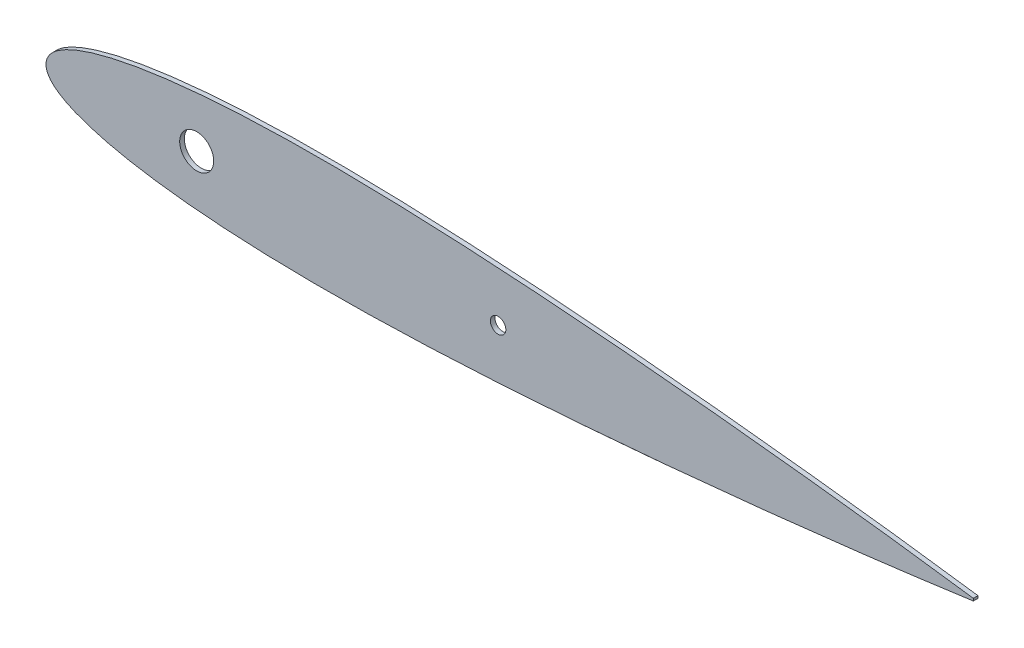
ISO-10303-21;
HEADER;
FILE_DESCRIPTION(('STEP AP214'),'2;1');
FILE_NAME('part.step','',(''),(''),'','','');
FILE_SCHEMA(('AUTOMOTIVE_DESIGN { 1 0 10303 214 1 1 1 1 }'));
ENDSEC;
DATA;
#1=APPLICATION_CONTEXT('core data for automotive mechanical design processes');
#2=APPLICATION_PROTOCOL_DEFINITION('international standard','automotive_design',2000,#1);
#3=PRODUCT_CONTEXT('',#1,'mechanical');
#4=PRODUCT('Part','Part','',(#3));
#5=PRODUCT_RELATED_PRODUCT_CATEGORY('part','',(#4));
#6=PRODUCT_DEFINITION_FORMATION('','',#4);
#7=PRODUCT_DEFINITION_CONTEXT('part definition',#1,'design');
#8=PRODUCT_DEFINITION('design','',#6,#7);
#9=PRODUCT_DEFINITION_SHAPE('','',#8);
#10=(LENGTH_UNIT() NAMED_UNIT(*) SI_UNIT(.MILLI.,.METRE.));
#11=(NAMED_UNIT(*) PLANE_ANGLE_UNIT() SI_UNIT($,.RADIAN.));
#12=(NAMED_UNIT(*) SI_UNIT($,.STERADIAN.) SOLID_ANGLE_UNIT());
#13=UNCERTAINTY_MEASURE_WITH_UNIT(LENGTH_MEASURE(1.E-05),#10,'distance_accuracy_value','');
#14=(GEOMETRIC_REPRESENTATION_CONTEXT(3) GLOBAL_UNCERTAINTY_ASSIGNED_CONTEXT((#13)) GLOBAL_UNIT_ASSIGNED_CONTEXT((#10,
#11,#12)) REPRESENTATION_CONTEXT('',''));
#15=CARTESIAN_POINT('',(0.,0.,0.));
#16=DIRECTION('',(0.,0.,1.));
#17=DIRECTION('',(1.,0.,0.));
#18=AXIS2_PLACEMENT_3D('',#15,#16,#17);
#19=CARTESIAN_POINT('',(300.,0.378000085791609,1.5));
#20=CARTESIAN_POINT('',(299.270406258191,0.479445930510089,1.5));
#21=CARTESIAN_POINT('',(297.234666466675,0.762503926958,1.5));
#22=CARTESIAN_POINT('',(293.659648722087,1.25767379104877,1.5));
#23=CARTESIAN_POINT('',(289.112409324718,1.87424286789427,1.5));
#24=CARTESIAN_POINT('',(284.080813047262,2.54451801768942,1.5));
#25=CARTESIAN_POINT('',(278.752039397676,3.23812305057752,1.5));
#26=CARTESIAN_POINT('',(273.265892957003,3.93494732849236,1.5));
#27=CARTESIAN_POINT('',(267.705948145067,4.62902099310313,1.5));
#28=CARTESIAN_POINT('',(262.11455442435,5.31307031240521,1.5));
#29=CARTESIAN_POINT('',(256.508339041981,5.98219316973479,1.5));
#30=CARTESIAN_POINT('',(250.891727852537,6.63799231512843,1.5));
#31=CARTESIAN_POINT('',(245.269544547784,7.28178088713811,1.5));
#32=CARTESIAN_POINT('',(239.647331655705,7.91223455869203,1.5));
#33=CARTESIAN_POINT('',(234.025115138361,8.52699398080196,1.5));
#34=CARTESIAN_POINT('',(228.399071657966,9.12623183448517,1.5));
#35=CARTESIAN_POINT('',(222.768240122571,9.71307980985144,1.5));
#36=CARTESIAN_POINT('',(217.135901992854,10.2874621437678,1.5));
#37=CARTESIAN_POINT('',(211.505390076212,10.8469435449553,1.5));
#38=CARTESIAN_POINT('',(205.877598448554,11.3916454113055,1.5));
#39=CARTESIAN_POINT('',(200.251489742703,11.9208873285715,1.5));
#40=CARTESIAN_POINT('',(194.626396629031,12.434619899248,1.5));
#41=CARTESIAN_POINT('',(189.002771953878,12.9319147435066,1.5));
#42=CARTESIAN_POINT('',(183.38150447918,13.4131006245795,1.5));
#43=CARTESIAN_POINT('',(177.763197882755,13.8763798492964,1.5));
#44=CARTESIAN_POINT('',(172.14827252579,14.3212404427839,1.5));
#45=CARTESIAN_POINT('',(166.537499181283,14.7478242644365,1.5));
#46=CARTESIAN_POINT('',(160.931704641983,15.1542315822592,1.5));
#47=CARTESIAN_POINT('',(155.33167602762,15.5391043814319,1.5));
#48=CARTESIAN_POINT('',(149.737504253089,15.9026531717,1.5));
#49=CARTESIAN_POINT('',(144.148652919445,16.2418498035663,1.5));
#50=CARTESIAN_POINT('',(138.565642977727,16.5574243030181,1.5));
#51=CARTESIAN_POINT('',(132.990821911634,16.8474013776407,1.5));
#52=CARTESIAN_POINT('',(127.427400286611,17.1102155605444,1.5));
#53=CARTESIAN_POINT('',(121.87757922466,17.3438956525449,1.5));
#54=CARTESIAN_POINT('',(116.340716908339,17.5452607935342,1.5));
#55=CARTESIAN_POINT('',(110.815433459798,17.7126831386236,1.5));
#56=CARTESIAN_POINT('',(105.301229224759,17.8445019865892,1.5));
#57=CARTESIAN_POINT('',(99.8005246938465,17.9400958831729,1.5));
#58=CARTESIAN_POINT('',(94.3173891780333,17.9965945216751,1.5));
#59=CARTESIAN_POINT('',(88.8557161622828,18.0101285441363,1.5));
#60=CARTESIAN_POINT('',(83.4185988364478,17.9792379195058,1.5));
#61=CARTESIAN_POINT('',(78.0084304611897,17.8991647740151,1.5));
#62=CARTESIAN_POINT('',(72.6284037782424,17.7670378182799,1.5));
#63=CARTESIAN_POINT('',(67.2826859463777,17.5794179221707,1.5));
#64=CARTESIAN_POINT('',(61.9773108914633,17.3315194209053,1.5));
#65=CARTESIAN_POINT('',(56.720635819959,17.021036512879,1.5));
#66=CARTESIAN_POINT('',(51.5251189470169,16.6409618454021,1.5));
#67=CARTESIAN_POINT('',(46.4081450832693,16.1901922640123,1.5));
#68=CARTESIAN_POINT('',(41.3941173921595,15.6616726526715,1.5));
#69=CARTESIAN_POINT('',(36.5156113066675,15.0539671994517,1.5));
#70=CARTESIAN_POINT('',(31.8189485954638,14.3656268642819,1.5));
#71=CARTESIAN_POINT('',(27.3661029727955,13.6034787702631,1.5));
#72=CARTESIAN_POINT('',(23.2351551610893,12.7825863440271,1.5));
#73=CARTESIAN_POINT('',(19.5025788109587,11.9202534557745,1.5));
#74=CARTESIAN_POINT('',(16.2182070077725,11.0446003021048,1.5));
#75=CARTESIAN_POINT('',(13.3891209887171,10.17507856394,1.5));
#76=CARTESIAN_POINT('',(10.9848637611105,9.33350083301349,1.5));
#77=CARTESIAN_POINT('',(8.96149544609951,8.52206481504193,1.5));
#78=CARTESIAN_POINT('',(7.26722563700955,7.74697775939542,1.5));
#79=CARTESIAN_POINT('',(5.84598572737673,7.01062721234568,1.5));
#80=CARTESIAN_POINT('',(4.64764407483787,6.30063546243398,1.5));
#81=CARTESIAN_POINT('',(3.62816800978606,5.60651493999262,1.5));
#82=CARTESIAN_POINT('',(2.75184175672906,4.92663636939089,1.5));
#83=CARTESIAN_POINT('',(2.00618975072553,4.24991822327021,1.5));
#84=CARTESIAN_POINT('',(1.39051838755926,3.57026030201865,1.5));
#85=CARTESIAN_POINT('',(0.90093257460337,2.89094290818633,1.5));
#86=CARTESIAN_POINT('',(0.529207590380769,2.22021977713321,1.5));
#87=CARTESIAN_POINT('',(0.260411531407396,1.56645929130344,1.5));
#88=CARTESIAN_POINT('',(0.0856446086735938,0.931036139353968,1.5));
#89=CARTESIAN_POINT('',(-0.00357731260794587,0.308981084614044,1.5));
#90=CARTESIAN_POINT('',(-0.00357731260776069,-0.308981084614867,1.5));
#91=CARTESIAN_POINT('',(0.085644608673676,-0.931036139354734,1.5));
#92=CARTESIAN_POINT('',(0.260411531407617,-1.56645929130417,1.5));
#93=CARTESIAN_POINT('',(0.529207590381385,-2.22021977713395,1.5));
#94=CARTESIAN_POINT('',(0.900932574603896,-2.89094290818701,1.5));
#95=CARTESIAN_POINT('',(1.39051838755998,-3.57026030201885,1.5));
#96=CARTESIAN_POINT('',(2.00618975072612,-4.2499182232723,1.5));
#97=CARTESIAN_POINT('',(2.75184175673132,-4.92663636938401,1.5));
#98=CARTESIAN_POINT('',(3.62816800978219,-5.60651494002358,1.5));
#99=CARTESIAN_POINT('',(4.64764407486163,-6.30063546229814,1.5));
#100=CARTESIAN_POINT('',(5.84598572727589,-7.01062721295839,1.5));
#101=CARTESIAN_POINT('',(7.26722563748649,-7.74697775654588,1.5));
#102=CARTESIAN_POINT('',(8.96149544385088,-8.52206482852457,1.5));
#103=CARTESIAN_POINT('',(10.9848637718125,-9.33350076889672,1.5));
#104=CARTESIAN_POINT('',(13.3891209381216,-10.1750788671249,1.5));
#105=CARTESIAN_POINT('',(16.2182072447028,-11.0445988824027,1.5));
#106=CARTESIAN_POINT('',(19.5025777214158,-11.9202599844474,1.5));
#107=CARTESIAN_POINT('',(23.2351600059408,-12.7825573131507,1.5));
#108=CARTESIAN_POINT('',(27.366065702866,-13.6035992472578,1.5));
#109=CARTESIAN_POINT('',(31.8190141628903,-14.3651166226759,1.5));
#110=CARTESIAN_POINT('',(36.5155748574454,-15.0541095127906,1.5));
#111=CARTESIAN_POINT('',(41.3941235310746,-15.6616324404357,1.5));
#112=CARTESIAN_POINT('',(46.4081433882142,-16.1902033672853,1.5));
#113=CARTESIAN_POINT('',(51.5251194115053,-16.6409588028351,1.5));
#114=CARTESIAN_POINT('',(56.7206356933644,-17.021037342131,1.5));
#115=CARTESIAN_POINT('',(61.9773109258477,-17.3315191956822,1.5));
#116=CARTESIAN_POINT('',(67.282685937066,-17.579417983174,1.5));
#117=CARTESIAN_POINT('',(72.628403780765,-17.7670378017618,1.5));
#118=CARTESIAN_POINT('',(78.0084304605122,-17.8991647784589,1.5));
#119=CARTESIAN_POINT('',(83.4185988366347,-17.9792379182857,1.5));
#120=CARTESIAN_POINT('',(88.8557161622366,-18.0101285444439,1.5));
#121=CARTESIAN_POINT('',(94.31738917805,-17.996594521569,1.5));
#122=CARTESIAN_POINT('',(99.8005246938458,-17.9400958831769,1.5));
#123=CARTESIAN_POINT('',(105.301229224764,-17.8445019865623,1.5));
#124=CARTESIAN_POINT('',(110.8154334598,-17.7126831386035,1.5));
#125=CARTESIAN_POINT('',(116.340716908343,-17.5452607935109,1.5));
#126=CARTESIAN_POINT('',(121.877579224663,-17.3438956525209,1.5));
#127=CARTESIAN_POINT('',(127.427400286614,-17.1102155605192,1.5));
#128=CARTESIAN_POINT('',(132.990821911636,-16.8474013776144,1.5));
#129=CARTESIAN_POINT('',(138.56564297773,-16.5574243029907,1.5));
#130=CARTESIAN_POINT('',(144.148652919448,-16.2418498035377,1.5));
#131=CARTESIAN_POINT('',(149.737504253092,-15.9026531716702,1.5));
#132=CARTESIAN_POINT('',(155.331676027623,-15.5391043814009,1.5));
#133=CARTESIAN_POINT('',(160.931704641986,-15.1542315822272,1.5));
#134=CARTESIAN_POINT('',(166.537499181286,-14.7478242644034,1.5));
#135=CARTESIAN_POINT('',(172.148272525793,-14.3212404427496,1.5));
#136=CARTESIAN_POINT('',(177.763197882757,-13.8763798492609,1.5));
#137=CARTESIAN_POINT('',(183.381504479182,-13.4131006245429,1.5));
#138=CARTESIAN_POINT('',(189.002771953881,-12.9319147434689,1.5));
#139=CARTESIAN_POINT('',(194.626396629033,-12.4346198992091,1.5));
#140=CARTESIAN_POINT('',(200.251489742704,-11.9208873285315,1.5));
#141=CARTESIAN_POINT('',(205.877598448556,-11.3916454112643,1.5));
#142=CARTESIAN_POINT('',(211.505390076214,-10.846943544913,1.5));
#143=CARTESIAN_POINT('',(217.135901992857,-10.2874621437243,1.5));
#144=CARTESIAN_POINT('',(222.768240122572,-9.71307980980683,1.5));
#145=CARTESIAN_POINT('',(228.399071657967,-9.12623183443944,1.5));
#146=CARTESIAN_POINT('',(234.025115138362,-8.52699398075506,1.5));
#147=CARTESIAN_POINT('',(239.647331655707,-7.91223455864399,1.5));
#148=CARTESIAN_POINT('',(245.269544547784,-7.28178088708888,1.5));
#149=CARTESIAN_POINT('',(250.891727852538,-6.63799231507812,1.5));
#150=CARTESIAN_POINT('',(256.508339041983,-5.9821931696833,1.5));
#151=CARTESIAN_POINT('',(262.114554424351,-5.31307031235259,1.5));
#152=CARTESIAN_POINT('',(267.705948145068,-4.62902099304935,1.5));
#153=CARTESIAN_POINT('',(273.265892957004,-3.93494732843744,1.5));
#154=CARTESIAN_POINT('',(278.752039397677,-3.23812305052151,1.5));
#155=CARTESIAN_POINT('',(284.080813047263,-2.54451801763229,1.5));
#156=CARTESIAN_POINT('',(289.112409324719,-1.87424286783615,1.5));
#157=CARTESIAN_POINT('',(293.659648722086,-1.2576737909897,1.5));
#158=CARTESIAN_POINT('',(297.234666466675,-0.762503926898206,1.5));
#159=CARTESIAN_POINT('',(299.270406258191,-0.479445930449888,1.5));
#160=CARTESIAN_POINT('',(300.,-0.378000085731248,1.5));
#161=B_SPLINE_CURVE_WITH_KNOTS('',3,(#19,#20,#21,#22,#23,#24,#25,#26,#27,#28,#29,#30,#31,#32,
#33,#34,#35,#36,#37,#38,#39,#40,#41,#42,#43,#44,#45,#46,#47,#48,#49,#50,#51,#52,#53,#54,#55,#56,
#57,#58,#59,#60,#61,#62,#63,#64,#65,#66,#67,#68,#69,#70,#71,#72,#73,#74,#75,#76,#77,#78,#79,#80,
#81,#82,#83,#84,#85,#86,#87,#88,#89,#90,#91,#92,#93,#94,#95,#96,#97,#98,#99,#100,#101,#102,#103,
#104,#105,#106,#107,#108,#109,#110,#111,#112,#113,#114,#115,#116,#117,#118,#119,#120,#121,#122,
#123,#124,#125,#126,#127,#128,#129,#130,#131,#132,#133,#134,#135,#136,#137,#138,#139,#140,#141,
#142,#143,#144,#145,#146,#147,#148,#149,#150,#151,#152,#153,#154,#155,#156,#157,#158,#159,#160),
.UNSPECIFIED.,.F.,.F.,(4,1,1,1,1,1,1,1,1,1,1,1,1,1,1,1,1,1,1,1,1,1,1,1,1,1,1,1,1,1,1,1,1,1,1,1,
1,1,1,1,1,1,1,1,1,1,1,1,1,1,1,1,1,1,1,1,1,1,1,1,1,1,1,1,1,1,1,1,1,1,1,1,1,1,1,1,1,1,1,1,1,1,1,1,
1,1,1,1,1,1,1,1,1,1,1,1,1,1,1,1,1,1,1,1,1,1,1,1,1,1,1,1,1,1,1,1,1,1,1,1,1,1,1,1,1,1,1,1,1,1,1,1,
1,1,1,1,1,1,1,4),(0.,0.00361222059404388,0.0100789532278554,0.0176986181570895,
0.0261151107220122,0.0349709660638799,0.0440503796486832,0.0532343297369713,0.0624475697827881,
0.0716739929600303,0.0809213185094618,0.0901775382979332,0.0994243421366575,0.108664440992277,
0.117912199004999,0.127169502180609,0.136426594565023,0.145675425736823,0.154916495397513,
0.164153236916375,0.173386648526191,0.182615736180586,0.191838089492061,0.201053134496137,
0.210260392550908,0.219458942389608,0.228646746886173,0.237822316287067,0.24698522413025,
0.25613738364592,0.265279415916296,0.274406949966901,0.283512193452554,0.292591781113348,
0.30164628535433,0.310681792653752,0.31969906757785,0.32869451957993,0.337660159695399,
0.346588583205171,0.355477411634764,0.364322937295264,0.373121613643215,0.381867635356829,
0.390553004884712,0.399166025869356,0.407689628257838,0.416098119030288,0.424354887451602,
0.432412428746428,0.440204728485537,0.447630505181733,0.454563637698397,0.460855379429517,
0.466413319364109,0.471228610451128,0.475365774282038,0.478901259753558,0.481915077255184,
0.484498871900912,0.486747127386087,0.488741251833575,0.490543179252672,0.492182103901344,
0.493672830547239,0.495031907807012,0.496279059618418,0.497424736506128,0.498490165528455,
0.499502757789975,0.500497253863142,0.501509846124661,0.502575275146988,0.503720952034698,
0.504968103846104,0.506327181105877,0.507817907751772,0.509456832400444,0.511258759819541,
0.51325288426703,0.515501139752205,0.518084934397933,0.521098751899559,0.524634237371078,
0.528771401201989,0.533586692289008,0.539144632223599,0.545436373954719,0.552369506471383,
0.559795200118754,0.567587571253572,0.575645112548398,0.583901880969712,0.592310371742162,
0.600833974130644,0.609446995115288,0.618132364643171,0.626878386356785,0.635677062704736,
0.644522588365236,0.653411416794829,0.662339840304601,0.67130548042007,0.68030093242215,
0.689318207346248,0.69835371464567,0.707408218886652,0.716487806547446,0.725593050033099,
0.734720584083704,0.74386261635408,0.75301477586975,0.762177683712933,0.771353253113827,
0.780541057610392,0.789739607449093,0.798946865503863,0.808161910507939,0.817384263819414,
0.826613351473809,0.835846763083625,0.845083504602487,0.854324574263177,0.863573405434977,
0.872830497819391,0.882087800995001,0.891335559007723,0.900575657863343,0.909822461702067,
0.919078681490538,0.92832600703997,0.937552430217212,0.946765670263029,0.955949620351317,
0.96502903393612,0.973884889277988,0.982301381842911,0.989921046772145,0.996387779405956,1.),.UNSPECIFIED.);
#162=DIRECTION('',(0.,0.,-1.));
#163=VECTOR('',#162,1.);
#164=SURFACE_OF_LINEAR_EXTRUSION('',#161,#163);
#165=CARTESIAN_POINT('',(300.,0.378000085791609,0.));
#166=CARTESIAN_POINT('',(299.270406258191,0.479445930510089,0.));
#167=CARTESIAN_POINT('',(297.234666466675,0.762503926958,0.));
#168=CARTESIAN_POINT('',(293.659648722087,1.25767379104877,0.));
#169=CARTESIAN_POINT('',(289.112409324718,1.87424286789427,0.));
#170=CARTESIAN_POINT('',(284.080813047262,2.54451801768942,0.));
#171=CARTESIAN_POINT('',(278.752039397676,3.23812305057752,0.));
#172=CARTESIAN_POINT('',(273.265892957003,3.93494732849236,0.));
#173=CARTESIAN_POINT('',(267.705948145067,4.62902099310313,0.));
#174=CARTESIAN_POINT('',(262.11455442435,5.31307031240521,0.));
#175=CARTESIAN_POINT('',(256.508339041981,5.98219316973479,0.));
#176=CARTESIAN_POINT('',(250.891727852537,6.63799231512843,0.));
#177=CARTESIAN_POINT('',(245.269544547784,7.28178088713811,0.));
#178=CARTESIAN_POINT('',(239.647331655705,7.91223455869203,0.));
#179=CARTESIAN_POINT('',(234.025115138361,8.52699398080196,0.));
#180=CARTESIAN_POINT('',(228.399071657966,9.12623183448517,0.));
#181=CARTESIAN_POINT('',(222.768240122571,9.71307980985144,0.));
#182=CARTESIAN_POINT('',(217.135901992854,10.2874621437678,0.));
#183=CARTESIAN_POINT('',(211.505390076212,10.8469435449553,0.));
#184=CARTESIAN_POINT('',(205.877598448554,11.3916454113055,0.));
#185=CARTESIAN_POINT('',(200.251489742703,11.9208873285715,0.));
#186=CARTESIAN_POINT('',(194.626396629031,12.434619899248,0.));
#187=CARTESIAN_POINT('',(189.002771953878,12.9319147435066,0.));
#188=CARTESIAN_POINT('',(183.38150447918,13.4131006245795,0.));
#189=CARTESIAN_POINT('',(177.763197882755,13.8763798492964,0.));
#190=CARTESIAN_POINT('',(172.14827252579,14.3212404427839,0.));
#191=CARTESIAN_POINT('',(166.537499181283,14.7478242644365,0.));
#192=CARTESIAN_POINT('',(160.931704641983,15.1542315822592,0.));
#193=CARTESIAN_POINT('',(155.33167602762,15.5391043814319,0.));
#194=CARTESIAN_POINT('',(149.737504253089,15.9026531717,0.));
#195=CARTESIAN_POINT('',(144.148652919445,16.2418498035663,0.));
#196=CARTESIAN_POINT('',(138.565642977727,16.5574243030181,0.));
#197=CARTESIAN_POINT('',(132.990821911634,16.8474013776407,0.));
#198=CARTESIAN_POINT('',(127.427400286611,17.1102155605444,0.));
#199=CARTESIAN_POINT('',(121.87757922466,17.3438956525449,0.));
#200=CARTESIAN_POINT('',(116.340716908339,17.5452607935342,0.));
#201=CARTESIAN_POINT('',(110.815433459798,17.7126831386236,0.));
#202=CARTESIAN_POINT('',(105.301229224759,17.8445019865892,0.));
#203=CARTESIAN_POINT('',(99.8005246938465,17.9400958831729,0.));
#204=CARTESIAN_POINT('',(94.3173891780333,17.9965945216751,0.));
#205=CARTESIAN_POINT('',(88.8557161622828,18.0101285441363,0.));
#206=CARTESIAN_POINT('',(83.4185988364478,17.9792379195058,0.));
#207=CARTESIAN_POINT('',(78.0084304611897,17.8991647740151,0.));
#208=CARTESIAN_POINT('',(72.6284037782424,17.7670378182799,0.));
#209=CARTESIAN_POINT('',(67.2826859463777,17.5794179221707,0.));
#210=CARTESIAN_POINT('',(61.9773108914633,17.3315194209053,0.));
#211=CARTESIAN_POINT('',(56.720635819959,17.021036512879,0.));
#212=CARTESIAN_POINT('',(51.5251189470169,16.6409618454021,0.));
#213=CARTESIAN_POINT('',(46.4081450832693,16.1901922640123,0.));
#214=CARTESIAN_POINT('',(41.3941173921595,15.6616726526715,0.));
#215=CARTESIAN_POINT('',(36.5156113066675,15.0539671994517,0.));
#216=CARTESIAN_POINT('',(31.8189485954638,14.3656268642819,0.));
#217=CARTESIAN_POINT('',(27.3661029727955,13.6034787702631,0.));
#218=CARTESIAN_POINT('',(23.2351551610893,12.7825863440271,0.));
#219=CARTESIAN_POINT('',(19.5025788109587,11.9202534557745,0.));
#220=CARTESIAN_POINT('',(16.2182070077725,11.0446003021048,0.));
#221=CARTESIAN_POINT('',(13.3891209887171,10.17507856394,0.));
#222=CARTESIAN_POINT('',(10.9848637611105,9.33350083301349,0.));
#223=CARTESIAN_POINT('',(8.96149544609951,8.52206481504193,0.));
#224=CARTESIAN_POINT('',(7.26722563700955,7.74697775939542,0.));
#225=CARTESIAN_POINT('',(5.84598572737673,7.01062721234568,0.));
#226=CARTESIAN_POINT('',(4.64764407483787,6.30063546243398,0.));
#227=CARTESIAN_POINT('',(3.62816800978606,5.60651493999262,0.));
#228=CARTESIAN_POINT('',(2.75184175672906,4.92663636939089,0.));
#229=CARTESIAN_POINT('',(2.00618975072553,4.24991822327021,0.));
#230=CARTESIAN_POINT('',(1.39051838755926,3.57026030201865,0.));
#231=CARTESIAN_POINT('',(0.90093257460337,2.89094290818633,0.));
#232=CARTESIAN_POINT('',(0.529207590380769,2.22021977713321,0.));
#233=CARTESIAN_POINT('',(0.260411531407396,1.56645929130344,0.));
#234=CARTESIAN_POINT('',(0.0856446086735938,0.931036139353968,0.));
#235=CARTESIAN_POINT('',(-0.00357731260794587,0.308981084614044,0.));
#236=CARTESIAN_POINT('',(-0.00357731260776069,-0.308981084614867,0.));
#237=CARTESIAN_POINT('',(0.085644608673676,-0.931036139354734,0.));
#238=CARTESIAN_POINT('',(0.260411531407617,-1.56645929130417,0.));
#239=CARTESIAN_POINT('',(0.529207590381385,-2.22021977713395,0.));
#240=CARTESIAN_POINT('',(0.900932574603896,-2.89094290818701,0.));
#241=CARTESIAN_POINT('',(1.39051838755998,-3.57026030201885,0.));
#242=CARTESIAN_POINT('',(2.00618975072612,-4.2499182232723,0.));
#243=CARTESIAN_POINT('',(2.75184175673132,-4.92663636938401,0.));
#244=CARTESIAN_POINT('',(3.62816800978219,-5.60651494002358,0.));
#245=CARTESIAN_POINT('',(4.64764407486163,-6.30063546229814,0.));
#246=CARTESIAN_POINT('',(5.84598572727589,-7.01062721295839,0.));
#247=CARTESIAN_POINT('',(7.26722563748649,-7.74697775654588,0.));
#248=CARTESIAN_POINT('',(8.96149544385088,-8.52206482852457,0.));
#249=CARTESIAN_POINT('',(10.9848637718125,-9.33350076889672,0.));
#250=CARTESIAN_POINT('',(13.3891209381216,-10.1750788671249,0.));
#251=CARTESIAN_POINT('',(16.2182072447028,-11.0445988824027,0.));
#252=CARTESIAN_POINT('',(19.5025777214158,-11.9202599844474,0.));
#253=CARTESIAN_POINT('',(23.2351600059408,-12.7825573131507,0.));
#254=CARTESIAN_POINT('',(27.366065702866,-13.6035992472578,0.));
#255=CARTESIAN_POINT('',(31.8190141628903,-14.3651166226759,0.));
#256=CARTESIAN_POINT('',(36.5155748574454,-15.0541095127906,0.));
#257=CARTESIAN_POINT('',(41.3941235310746,-15.6616324404357,0.));
#258=CARTESIAN_POINT('',(46.4081433882142,-16.1902033672853,0.));
#259=CARTESIAN_POINT('',(51.5251194115053,-16.6409588028351,0.));
#260=CARTESIAN_POINT('',(56.7206356933644,-17.021037342131,0.));
#261=CARTESIAN_POINT('',(61.9773109258477,-17.3315191956822,0.));
#262=CARTESIAN_POINT('',(67.282685937066,-17.579417983174,0.));
#263=CARTESIAN_POINT('',(72.628403780765,-17.7670378017618,0.));
#264=CARTESIAN_POINT('',(78.0084304605122,-17.8991647784589,0.));
#265=CARTESIAN_POINT('',(83.4185988366347,-17.9792379182857,0.));
#266=CARTESIAN_POINT('',(88.8557161622366,-18.0101285444439,0.));
#267=CARTESIAN_POINT('',(94.31738917805,-17.996594521569,0.));
#268=CARTESIAN_POINT('',(99.8005246938458,-17.9400958831769,0.));
#269=CARTESIAN_POINT('',(105.301229224764,-17.8445019865623,0.));
#270=CARTESIAN_POINT('',(110.8154334598,-17.7126831386035,0.));
#271=CARTESIAN_POINT('',(116.340716908343,-17.5452607935109,0.));
#272=CARTESIAN_POINT('',(121.877579224663,-17.3438956525209,0.));
#273=CARTESIAN_POINT('',(127.427400286614,-17.1102155605192,0.));
#274=CARTESIAN_POINT('',(132.990821911636,-16.8474013776144,0.));
#275=CARTESIAN_POINT('',(138.56564297773,-16.5574243029907,0.));
#276=CARTESIAN_POINT('',(144.148652919448,-16.2418498035377,0.));
#277=CARTESIAN_POINT('',(149.737504253092,-15.9026531716702,0.));
#278=CARTESIAN_POINT('',(155.331676027623,-15.5391043814009,0.));
#279=CARTESIAN_POINT('',(160.931704641986,-15.1542315822272,0.));
#280=CARTESIAN_POINT('',(166.537499181286,-14.7478242644034,0.));
#281=CARTESIAN_POINT('',(172.148272525793,-14.3212404427496,0.));
#282=CARTESIAN_POINT('',(177.763197882757,-13.8763798492609,0.));
#283=CARTESIAN_POINT('',(183.381504479182,-13.4131006245429,0.));
#284=CARTESIAN_POINT('',(189.002771953881,-12.9319147434689,0.));
#285=CARTESIAN_POINT('',(194.626396629033,-12.4346198992091,0.));
#286=CARTESIAN_POINT('',(200.251489742704,-11.9208873285315,0.));
#287=CARTESIAN_POINT('',(205.877598448556,-11.3916454112643,0.));
#288=CARTESIAN_POINT('',(211.505390076214,-10.846943544913,0.));
#289=CARTESIAN_POINT('',(217.135901992857,-10.2874621437243,0.));
#290=CARTESIAN_POINT('',(222.768240122572,-9.71307980980683,0.));
#291=CARTESIAN_POINT('',(228.399071657967,-9.12623183443944,0.));
#292=CARTESIAN_POINT('',(234.025115138362,-8.52699398075506,0.));
#293=CARTESIAN_POINT('',(239.647331655707,-7.91223455864399,0.));
#294=CARTESIAN_POINT('',(245.269544547784,-7.28178088708888,0.));
#295=CARTESIAN_POINT('',(250.891727852538,-6.63799231507812,0.));
#296=CARTESIAN_POINT('',(256.508339041983,-5.9821931696833,0.));
#297=CARTESIAN_POINT('',(262.114554424351,-5.31307031235259,0.));
#298=CARTESIAN_POINT('',(267.705948145068,-4.62902099304935,0.));
#299=CARTESIAN_POINT('',(273.265892957004,-3.93494732843744,0.));
#300=CARTESIAN_POINT('',(278.752039397677,-3.23812305052151,0.));
#301=CARTESIAN_POINT('',(284.080813047263,-2.54451801763229,0.));
#302=CARTESIAN_POINT('',(289.112409324719,-1.87424286783615,0.));
#303=CARTESIAN_POINT('',(293.659648722086,-1.2576737909897,0.));
#304=CARTESIAN_POINT('',(297.234666466675,-0.762503926898206,0.));
#305=CARTESIAN_POINT('',(299.270406258191,-0.479445930449888,0.));
#306=CARTESIAN_POINT('',(300.,-0.378000085731248,0.));
#307=B_SPLINE_CURVE_WITH_KNOTS('',3,(#165,#166,#167,#168,#169,#170,#171,#172,#173,#174,#175,
#176,#177,#178,#179,#180,#181,#182,#183,#184,#185,#186,#187,#188,#189,#190,#191,#192,#193,#194,
#195,#196,#197,#198,#199,#200,#201,#202,#203,#204,#205,#206,#207,#208,#209,#210,#211,#212,#213,
#214,#215,#216,#217,#218,#219,#220,#221,#222,#223,#224,#225,#226,#227,#228,#229,#230,#231,#232,
#233,#234,#235,#236,#237,#238,#239,#240,#241,#242,#243,#244,#245,#246,#247,#248,#249,#250,#251,
#252,#253,#254,#255,#256,#257,#258,#259,#260,#261,#262,#263,#264,#265,#266,#267,#268,#269,#270,
#271,#272,#273,#274,#275,#276,#277,#278,#279,#280,#281,#282,#283,#284,#285,#286,#287,#288,#289,
#290,#291,#292,#293,#294,#295,#296,#297,#298,#299,#300,#301,#302,#303,#304,#305,#306),
.UNSPECIFIED.,.F.,.F.,(4,1,1,1,1,1,1,1,1,1,1,1,1,1,1,1,1,1,1,1,1,1,1,1,1,1,1,1,1,1,1,1,1,1,1,1,
1,1,1,1,1,1,1,1,1,1,1,1,1,1,1,1,1,1,1,1,1,1,1,1,1,1,1,1,1,1,1,1,1,1,1,1,1,1,1,1,1,1,1,1,1,1,1,1,
1,1,1,1,1,1,1,1,1,1,1,1,1,1,1,1,1,1,1,1,1,1,1,1,1,1,1,1,1,1,1,1,1,1,1,1,1,1,1,1,1,1,1,1,1,1,1,1,
1,1,1,1,1,1,1,4),(0.,0.00361222059404388,0.0100789532278554,0.0176986181570895,
0.0261151107220122,0.0349709660638799,0.0440503796486832,0.0532343297369713,0.0624475697827881,
0.0716739929600303,0.0809213185094618,0.0901775382979332,0.0994243421366575,0.108664440992277,
0.117912199004999,0.127169502180609,0.136426594565023,0.145675425736823,0.154916495397513,
0.164153236916375,0.173386648526191,0.182615736180586,0.191838089492061,0.201053134496137,
0.210260392550908,0.219458942389608,0.228646746886173,0.237822316287067,0.24698522413025,
0.25613738364592,0.265279415916296,0.274406949966901,0.283512193452554,0.292591781113348,
0.30164628535433,0.310681792653752,0.31969906757785,0.32869451957993,0.337660159695399,
0.346588583205171,0.355477411634764,0.364322937295264,0.373121613643215,0.381867635356829,
0.390553004884712,0.399166025869356,0.407689628257838,0.416098119030288,0.424354887451602,
0.432412428746428,0.440204728485537,0.447630505181733,0.454563637698397,0.460855379429517,
0.466413319364109,0.471228610451128,0.475365774282038,0.478901259753558,0.481915077255184,
0.484498871900912,0.486747127386087,0.488741251833575,0.490543179252672,0.492182103901344,
0.493672830547239,0.495031907807012,0.496279059618418,0.497424736506128,0.498490165528455,
0.499502757789975,0.500497253863142,0.501509846124661,0.502575275146988,0.503720952034698,
0.504968103846104,0.506327181105877,0.507817907751772,0.509456832400444,0.511258759819541,
0.51325288426703,0.515501139752205,0.518084934397933,0.521098751899559,0.524634237371078,
0.528771401201989,0.533586692289008,0.539144632223599,0.545436373954719,0.552369506471383,
0.559795200118754,0.567587571253572,0.575645112548398,0.583901880969712,0.592310371742162,
0.600833974130644,0.609446995115288,0.618132364643171,0.626878386356785,0.635677062704736,
0.644522588365236,0.653411416794829,0.662339840304601,0.67130548042007,0.68030093242215,
0.689318207346248,0.69835371464567,0.707408218886652,0.716487806547446,0.725593050033099,
0.734720584083704,0.74386261635408,0.75301477586975,0.762177683712933,0.771353253113827,
0.780541057610392,0.789739607449093,0.798946865503863,0.808161910507939,0.817384263819414,
0.826613351473809,0.835846763083625,0.845083504602487,0.854324574263177,0.863573405434977,
0.872830497819391,0.882087800995001,0.891335559007723,0.900575657863343,0.909822461702067,
0.919078681490538,0.92832600703997,0.937552430217212,0.946765670263029,0.955949620351317,
0.96502903393612,0.973884889277988,0.982301381842911,0.989921046772145,0.996387779405956,1.),.UNSPECIFIED.);
#308=CARTESIAN_POINT('',(300.,0.378000085791609,0.));
#309=VERTEX_POINT('',#308);
#310=CARTESIAN_POINT('',(300.,-0.378000085731248,0.));
#311=VERTEX_POINT('',#310);
#312=EDGE_CURVE('E69',#309,#311,#307,.T.);
#313=ORIENTED_EDGE('',*,*,#312,.T.);
#314=DIRECTION('',(0.,0.,-1.));
#315=VECTOR('',#314,1.);
#316=CARTESIAN_POINT('',(300.,-0.378000085731248,1.5));
#317=LINE('',#316,#315);
#318=CARTESIAN_POINT('',(300.,-0.378000085731248,1.5));
#319=VERTEX_POINT('',#318);
#320=EDGE_CURVE('E11',#319,#311,#317,.T.);
#321=ORIENTED_EDGE('',*,*,#320,.F.);
#322=CARTESIAN_POINT('',(300.,0.378000085791609,1.5));
#323=VERTEX_POINT('',#322);
#324=EDGE_CURVE('E68',#323,#319,#161,.T.);
#325=ORIENTED_EDGE('',*,*,#324,.F.);
#326=DIRECTION('',(0.,0.,-1.));
#327=VECTOR('',#326,1.);
#328=CARTESIAN_POINT('',(300.,0.378000085791609,1.5));
#329=LINE('',#328,#327);
#330=EDGE_CURVE('E46',#323,#309,#329,.T.);
#331=ORIENTED_EDGE('',*,*,#330,.T.);
#332=EDGE_LOOP('',(#313,#321,#325,#331));
#333=FACE_BOUND('',#332,.T.);
#334=ADVANCED_FACE('F37',(#333),#164,.F.);
#335=CARTESIAN_POINT('',(300.,0.378000085791609,1.5));
#336=DIRECTION('',(-1.,0.,0.));
#337=DIRECTION('',(0.,0.,1.));
#338=AXIS2_PLACEMENT_3D('',#335,#336,#337);
#339=PLANE('',#338);
#340=DIRECTION('',(0.,1.,0.));
#341=VECTOR('',#340,1.);
#342=CARTESIAN_POINT('',(300.,0.378000085791609,0.));
#343=LINE('',#342,#341);
#344=EDGE_CURVE('E61',#311,#309,#343,.T.);
#345=ORIENTED_EDGE('',*,*,#344,.T.);
#346=ORIENTED_EDGE('',*,*,#330,.F.);
#347=DIRECTION('',(0.,1.,0.));
#348=VECTOR('',#347,1.);
#349=CARTESIAN_POINT('',(300.,0.378000085791609,1.5));
#350=LINE('',#349,#348);
#351=EDGE_CURVE('E53',#319,#323,#350,.T.);
#352=ORIENTED_EDGE('',*,*,#351,.F.);
#353=ORIENTED_EDGE('',*,*,#320,.T.);
#354=EDGE_LOOP('',(#345,#346,#352,#353));
#355=FACE_BOUND('',#354,.T.);
#356=ADVANCED_FACE('F64',(#355),#339,.F.);
#357=CARTESIAN_POINT('',(1.47835777548036E-12,3.56765419866399E-06,1.5));
#358=DIRECTION('',(0.,0.,-1.));
#359=DIRECTION('',(-1.,0.,0.));
#360=AXIS2_PLACEMENT_3D('',#357,#358,#359);
#361=PLANE('',#360);
#362=CARTESIAN_POINT('',(48.75,0.,1.5));
#363=DIRECTION('',(0.,0.,1.));
#364=DIRECTION('',(1.,0.,0.));
#365=AXIS2_PLACEMENT_3D('',#362,#363,#364);
#366=CIRCLE('',#365,5.50000000000002);
#367=CARTESIAN_POINT('',(54.25,0.,1.5));
#368=VERTEX_POINT('',#367);
#369=EDGE_CURVE('E76',#368,#368,#366,.T.);
#370=ORIENTED_EDGE('',*,*,#369,.F.);
#371=EDGE_LOOP('',(#370));
#372=FACE_BOUND('',#371,.T.);
#373=CARTESIAN_POINT('',(146.25,0.,1.5));
#374=DIRECTION('',(0.,0.,1.));
#375=DIRECTION('',(1.,0.,0.));
#376=AXIS2_PLACEMENT_3D('',#373,#374,#375);
#377=CIRCLE('',#376,2.50000000000002);
#378=CARTESIAN_POINT('',(148.75,0.,1.5));
#379=VERTEX_POINT('',#378);
#380=EDGE_CURVE('E88',#379,#379,#377,.T.);
#381=ORIENTED_EDGE('',*,*,#380,.F.);
#382=EDGE_LOOP('',(#381));
#383=FACE_BOUND('',#382,.T.);
#384=ORIENTED_EDGE('',*,*,#324,.T.);
#385=ORIENTED_EDGE('',*,*,#351,.T.);
#386=EDGE_LOOP('',(#384,#385));
#387=FACE_BOUND('',#386,.T.);
#388=ADVANCED_FACE('F102',(#372,#383,#387),#361,.F.);
#389=CARTESIAN_POINT('',(1.47835777548036E-12,3.56765419866399E-06,0.));
#390=DIRECTION('',(0.,0.,-1.));
#391=DIRECTION('',(-1.,0.,0.));
#392=AXIS2_PLACEMENT_3D('',#389,#390,#391);
#393=PLANE('',#392);
#394=CARTESIAN_POINT('',(48.75,0.,0.));
#395=DIRECTION('',(0.,0.,1.));
#396=DIRECTION('',(1.,0.,0.));
#397=AXIS2_PLACEMENT_3D('',#394,#395,#396);
#398=CIRCLE('',#397,5.50000000000002);
#399=CARTESIAN_POINT('',(54.25,0.,0.));
#400=VERTEX_POINT('',#399);
#401=EDGE_CURVE('E73',#400,#400,#398,.T.);
#402=ORIENTED_EDGE('',*,*,#401,.T.);
#403=EDGE_LOOP('',(#402));
#404=FACE_BOUND('',#403,.T.);
#405=CARTESIAN_POINT('',(146.25,0.,0.));
#406=DIRECTION('',(0.,0.,1.));
#407=DIRECTION('',(1.,0.,0.));
#408=AXIS2_PLACEMENT_3D('',#405,#406,#407);
#409=CIRCLE('',#408,2.50000000000002);
#410=CARTESIAN_POINT('',(148.75,0.,0.));
#411=VERTEX_POINT('',#410);
#412=EDGE_CURVE('E94',#411,#411,#409,.T.);
#413=ORIENTED_EDGE('',*,*,#412,.T.);
#414=EDGE_LOOP('',(#413));
#415=FACE_BOUND('',#414,.T.);
#416=ORIENTED_EDGE('',*,*,#312,.F.);
#417=ORIENTED_EDGE('',*,*,#344,.F.);
#418=EDGE_LOOP('',(#416,#417));
#419=FACE_BOUND('',#418,.T.);
#420=ADVANCED_FACE('F72',(#404,#415,#419),#393,.T.);
#421=CARTESIAN_POINT('',(146.25,0.,0.));
#422=DIRECTION('',(0.,0.,1.));
#423=DIRECTION('',(1.,0.,0.));
#424=AXIS2_PLACEMENT_3D('',#421,#422,#423);
#425=CYLINDRICAL_SURFACE('',#424,2.50000000000002);
#426=ORIENTED_EDGE('',*,*,#412,.F.);
#427=EDGE_LOOP('',(#426));
#428=FACE_BOUND('',#427,.T.);
#429=ORIENTED_EDGE('',*,*,#380,.T.);
#430=EDGE_LOOP('',(#429));
#431=FACE_BOUND('',#430,.T.);
#432=ADVANCED_FACE('F108',(#428,#431),#425,.F.);
#433=CARTESIAN_POINT('',(48.75,0.,0.));
#434=DIRECTION('',(0.,0.,1.));
#435=DIRECTION('',(1.,0.,0.));
#436=AXIS2_PLACEMENT_3D('',#433,#434,#435);
#437=CYLINDRICAL_SURFACE('',#436,5.50000000000002);
#438=ORIENTED_EDGE('',*,*,#401,.F.);
#439=EDGE_LOOP('',(#438));
#440=FACE_BOUND('',#439,.T.);
#441=ORIENTED_EDGE('',*,*,#369,.T.);
#442=EDGE_LOOP('',(#441));
#443=FACE_BOUND('',#442,.T.);
#444=ADVANCED_FACE('F100',(#440,#443),#437,.F.);
#445=CLOSED_SHELL('',(#334,#356,#388,#420,#432,#444));
#446=MANIFOLD_SOLID_BREP('B2',#445);
#447=ADVANCED_BREP_SHAPE_REPRESENTATION('',(#18,#446),#14);
#448=SHAPE_DEFINITION_REPRESENTATION(#9,#447);
ENDSEC;
END-ISO-10303-21;
